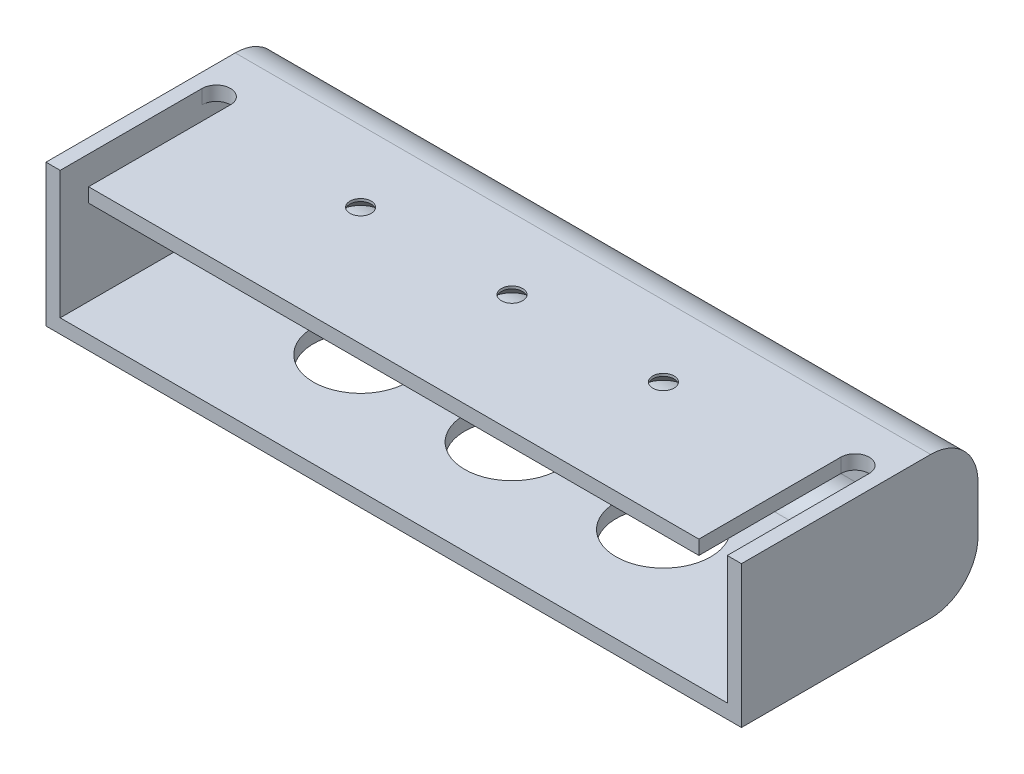
ISO-10303-21;
HEADER;
FILE_DESCRIPTION(('STEP AP214'),'2;1');
FILE_NAME('part.step','',(''),(''),'','','');
FILE_SCHEMA(('AUTOMOTIVE_DESIGN { 1 0 10303 214 1 1 1 1 }'));
ENDSEC;
DATA;
#1=APPLICATION_CONTEXT('core data for automotive mechanical design processes');
#2=APPLICATION_PROTOCOL_DEFINITION('international standard','automotive_design',2000,#1);
#3=PRODUCT_CONTEXT('',#1,'mechanical');
#4=PRODUCT('Part','Part','',(#3));
#5=PRODUCT_RELATED_PRODUCT_CATEGORY('part','',(#4));
#6=PRODUCT_DEFINITION_FORMATION('','',#4);
#7=PRODUCT_DEFINITION_CONTEXT('part definition',#1,'design');
#8=PRODUCT_DEFINITION('design','',#6,#7);
#9=PRODUCT_DEFINITION_SHAPE('','',#8);
#10=(LENGTH_UNIT() NAMED_UNIT(*) SI_UNIT(.MILLI.,.METRE.));
#11=(NAMED_UNIT(*) PLANE_ANGLE_UNIT() SI_UNIT($,.RADIAN.));
#12=(NAMED_UNIT(*) SI_UNIT($,.STERADIAN.) SOLID_ANGLE_UNIT());
#13=UNCERTAINTY_MEASURE_WITH_UNIT(LENGTH_MEASURE(1.E-05),#10,'distance_accuracy_value','');
#14=(GEOMETRIC_REPRESENTATION_CONTEXT(3) GLOBAL_UNCERTAINTY_ASSIGNED_CONTEXT((#13)) GLOBAL_UNIT_ASSIGNED_CONTEXT((#10,
#11,#12)) REPRESENTATION_CONTEXT('',''));
#15=CARTESIAN_POINT('',(0.,0.,0.));
#16=DIRECTION('',(0.,0.,1.));
#17=DIRECTION('',(1.,0.,0.));
#18=AXIS2_PLACEMENT_3D('',#15,#16,#17);
#19=CARTESIAN_POINT('',(-73.5,30.,25.));
#20=DIRECTION('',(0.,0.,-1.));
#21=DIRECTION('',(-1.,0.,0.));
#22=AXIS2_PLACEMENT_3D('',#19,#20,#21);
#23=PLANE('',#22);
#24=DIRECTION('',(0.,1.,0.));
#25=VECTOR('',#24,1.);
#26=CARTESIAN_POINT('',(64.5,-0.001000000000001,25.));
#27=LINE('',#26,#25);
#28=CARTESIAN_POINT('',(64.4999999999999,27.,25.));
#29=VERTEX_POINT('',#28);
#30=CARTESIAN_POINT('',(64.5,30.,25.));
#31=VERTEX_POINT('',#30);
#32=EDGE_CURVE('E159',#29,#31,#27,.T.);
#33=ORIENTED_EDGE('',*,*,#32,.T.);
#34=DIRECTION('',(1.,0.,0.));
#35=VECTOR('',#34,1.);
#36=CARTESIAN_POINT('',(-73.5,30.,25.));
#37=LINE('',#36,#35);
#38=CARTESIAN_POINT('',(-64.5,30.,25.));
#39=VERTEX_POINT('',#38);
#40=EDGE_CURVE('E173',#39,#31,#37,.T.);
#41=ORIENTED_EDGE('',*,*,#40,.F.);
#42=DIRECTION('',(0.,1.,0.));
#43=VECTOR('',#42,1.);
#44=CARTESIAN_POINT('',(-64.5,-0.001000000000001,25.));
#45=LINE('',#44,#43);
#46=CARTESIAN_POINT('',(-64.5,27.,25.));
#47=VERTEX_POINT('',#46);
#48=EDGE_CURVE('E266',#47,#39,#45,.T.);
#49=ORIENTED_EDGE('',*,*,#48,.F.);
#50=DIRECTION('',(1.,0.,0.));
#51=VECTOR('',#50,1.);
#52=CARTESIAN_POINT('',(-73.5,27.,25.));
#53=LINE('',#52,#51);
#54=EDGE_CURVE('E175',#47,#29,#53,.T.);
#55=ORIENTED_EDGE('',*,*,#54,.T.);
#56=EDGE_LOOP('',(#33,#41,#49,#55));
#57=FACE_BOUND('',#56,.T.);
#58=ADVANCED_FACE('F33',(#57),#23,.F.);
#59=CARTESIAN_POINT('',(70.5,30.,25.));
#60=VERTEX_POINT('',#59);
#61=CARTESIAN_POINT('',(73.5,30.,25.));
#62=VERTEX_POINT('',#61);
#63=EDGE_CURVE('E184',#60,#62,#37,.T.);
#64=ORIENTED_EDGE('',*,*,#63,.F.);
#65=DIRECTION('',(0.,-1.,0.));
#66=VECTOR('',#65,1.);
#67=CARTESIAN_POINT('',(70.5,30.,25.));
#68=LINE('',#67,#66);
#69=CARTESIAN_POINT('',(70.5,3.,25.));
#70=VERTEX_POINT('',#69);
#71=EDGE_CURVE('E313',#60,#70,#68,.T.);
#72=ORIENTED_EDGE('',*,*,#71,.T.);
#73=DIRECTION('',(1.,0.,0.));
#74=VECTOR('',#73,1.);
#75=CARTESIAN_POINT('',(-73.5,3.,25.));
#76=LINE('',#75,#74);
#77=CARTESIAN_POINT('',(-70.5,3.,25.));
#78=VERTEX_POINT('',#77);
#79=EDGE_CURVE('E291',#78,#70,#76,.T.);
#80=ORIENTED_EDGE('',*,*,#79,.F.);
#81=DIRECTION('',(0.,-1.,0.));
#82=VECTOR('',#81,1.);
#83=CARTESIAN_POINT('',(-70.5,30.,25.));
#84=LINE('',#83,#82);
#85=CARTESIAN_POINT('',(-70.5,30.,25.));
#86=VERTEX_POINT('',#85);
#87=EDGE_CURVE('E259',#86,#78,#84,.T.);
#88=ORIENTED_EDGE('',*,*,#87,.F.);
#89=CARTESIAN_POINT('',(-73.5,30.,25.));
#90=VERTEX_POINT('',#89);
#91=EDGE_CURVE('E183',#90,#86,#37,.T.);
#92=ORIENTED_EDGE('',*,*,#91,.F.);
#93=DIRECTION('',(0.,-1.,0.));
#94=VECTOR('',#93,1.);
#95=CARTESIAN_POINT('',(-73.5,30.,25.));
#96=LINE('',#95,#94);
#97=CARTESIAN_POINT('',(-73.5,0.,25.));
#98=VERTEX_POINT('',#97);
#99=EDGE_CURVE('E203',#90,#98,#96,.T.);
#100=ORIENTED_EDGE('',*,*,#99,.T.);
#101=DIRECTION('',(1.,0.,0.));
#102=VECTOR('',#101,1.);
#103=CARTESIAN_POINT('',(-73.5,0.,25.));
#104=LINE('',#103,#102);
#105=CARTESIAN_POINT('',(73.5,0.,25.));
#106=VERTEX_POINT('',#105);
#107=EDGE_CURVE('E198',#98,#106,#104,.T.);
#108=ORIENTED_EDGE('',*,*,#107,.T.);
#109=DIRECTION('',(0.,-1.,0.));
#110=VECTOR('',#109,1.);
#111=CARTESIAN_POINT('',(73.5,30.,25.));
#112=LINE('',#111,#110);
#113=EDGE_CURVE('E187',#62,#106,#112,.T.);
#114=ORIENTED_EDGE('',*,*,#113,.F.);
#115=EDGE_LOOP('',(#64,#72,#80,#88,#92,#100,#108,#114));
#116=FACE_BOUND('',#115,.T.);
#117=ADVANCED_FACE('F255',(#116),#23,.F.);
#118=CARTESIAN_POINT('',(0.,30.,0.));
#119=DIRECTION('',(0.,1.,0.));
#120=DIRECTION('',(0.,0.,1.));
#121=AXIS2_PLACEMENT_3D('',#118,#119,#120);
#122=PLANE('',#121);
#123=CARTESIAN_POINT('',(-32.,30.,0.));
#124=DIRECTION('',(0.,-1.,0.));
#125=DIRECTION('',(0.,0.,-1.));
#126=AXIS2_PLACEMENT_3D('',#123,#124,#125);
#127=CIRCLE('',#126,2.25);
#128=CARTESIAN_POINT('',(-32.,30.,-2.24999999999999));
#129=VERTEX_POINT('',#128);
#130=EDGE_CURVE('E394',#129,#129,#127,.T.);
#131=ORIENTED_EDGE('',*,*,#130,.T.);
#132=EDGE_LOOP('',(#131));
#133=FACE_BOUND('',#132,.T.);
#134=CARTESIAN_POINT('',(0.,30.,0.));
#135=DIRECTION('',(0.,-1.,0.));
#136=DIRECTION('',(0.,0.,-1.));
#137=AXIS2_PLACEMENT_3D('',#134,#135,#136);
#138=CIRCLE('',#137,2.25);
#139=CARTESIAN_POINT('',(0.,30.,-2.25));
#140=VERTEX_POINT('',#139);
#141=EDGE_CURVE('E403',#140,#140,#138,.T.);
#142=ORIENTED_EDGE('',*,*,#141,.T.);
#143=EDGE_LOOP('',(#142));
#144=FACE_BOUND('',#143,.T.);
#145=CARTESIAN_POINT('',(32.,30.,0.));
#146=DIRECTION('',(0.,-1.,0.));
#147=DIRECTION('',(0.,0.,-1.));
#148=AXIS2_PLACEMENT_3D('',#145,#146,#147);
#149=CIRCLE('',#148,2.25);
#150=CARTESIAN_POINT('',(32.,30.,-2.25));
#151=VERTEX_POINT('',#150);
#152=EDGE_CURVE('E412',#151,#151,#149,.T.);
#153=ORIENTED_EDGE('',*,*,#152,.T.);
#154=EDGE_LOOP('',(#153));
#155=FACE_BOUND('',#154,.T.);
#156=ORIENTED_EDGE('',*,*,#40,.T.);
#157=DIRECTION('',(0.,0.,-1.));
#158=VECTOR('',#157,1.);
#159=CARTESIAN_POINT('',(64.5,30.,25.));
#160=LINE('',#159,#158);
#161=CARTESIAN_POINT('',(64.5,30.,-5.));
#162=VERTEX_POINT('',#161);
#163=EDGE_CURVE('E156',#31,#162,#160,.T.);
#164=ORIENTED_EDGE('',*,*,#163,.T.);
#165=CARTESIAN_POINT('',(67.5,30.,-5.));
#166=DIRECTION('',(0.,-1.,0.));
#167=DIRECTION('',(0.,0.,1.));
#168=AXIS2_PLACEMENT_3D('',#165,#166,#167);
#169=CIRCLE('',#168,3.);
#170=CARTESIAN_POINT('',(70.5,30.,-5.));
#171=VERTEX_POINT('',#170);
#172=EDGE_CURVE('E415',#162,#171,#169,.T.);
#173=ORIENTED_EDGE('',*,*,#172,.T.);
#174=DIRECTION('',(0.,0.,1.));
#175=VECTOR('',#174,1.);
#176=CARTESIAN_POINT('',(70.5,30.,25.));
#177=LINE('',#176,#175);
#178=EDGE_CURVE('E417',#171,#60,#177,.T.);
#179=ORIENTED_EDGE('',*,*,#178,.T.);
#180=ORIENTED_EDGE('',*,*,#63,.T.);
#181=DIRECTION('',(0.,0.,-1.));
#182=VECTOR('',#181,1.);
#183=CARTESIAN_POINT('',(73.5,30.,-25.));
#184=LINE('',#183,#182);
#185=CARTESIAN_POINT('',(73.5,30.,-15.));
#186=VERTEX_POINT('',#185);
#187=EDGE_CURVE('E200',#62,#186,#184,.T.);
#188=ORIENTED_EDGE('',*,*,#187,.T.);
#189=DIRECTION('',(-1.,0.,0.));
#190=VECTOR('',#189,1.);
#191=CARTESIAN_POINT('',(-73.5,30.,-15.));
#192=LINE('',#191,#190);
#193=CARTESIAN_POINT('',(-73.5,30.,-15.));
#194=VERTEX_POINT('',#193);
#195=EDGE_CURVE('E212',#186,#194,#192,.T.);
#196=ORIENTED_EDGE('',*,*,#195,.T.);
#197=DIRECTION('',(0.,0.,1.));
#198=VECTOR('',#197,1.);
#199=CARTESIAN_POINT('',(-73.5,30.,-25.));
#200=LINE('',#199,#198);
#201=EDGE_CURVE('E188',#194,#90,#200,.T.);
#202=ORIENTED_EDGE('',*,*,#201,.T.);
#203=ORIENTED_EDGE('',*,*,#91,.T.);
#204=DIRECTION('',(0.,0.,1.));
#205=VECTOR('',#204,1.);
#206=CARTESIAN_POINT('',(-70.5,30.,25.));
#207=LINE('',#206,#205);
#208=CARTESIAN_POINT('',(-70.5,30.,-5.));
#209=VERTEX_POINT('',#208);
#210=EDGE_CURVE('E262',#209,#86,#207,.T.);
#211=ORIENTED_EDGE('',*,*,#210,.F.);
#212=CARTESIAN_POINT('',(-67.5,30.,-5.));
#213=DIRECTION('',(0.,1.,0.));
#214=DIRECTION('',(0.,0.,1.));
#215=AXIS2_PLACEMENT_3D('',#212,#213,#214);
#216=CIRCLE('',#215,3.);
#217=CARTESIAN_POINT('',(-64.5,30.,-5.));
#218=VERTEX_POINT('',#217);
#219=EDGE_CURVE('E264',#218,#209,#216,.T.);
#220=ORIENTED_EDGE('',*,*,#219,.F.);
#221=DIRECTION('',(0.,0.,-1.));
#222=VECTOR('',#221,1.);
#223=CARTESIAN_POINT('',(-64.5,30.,25.));
#224=LINE('',#223,#222);
#225=EDGE_CURVE('E182',#39,#218,#224,.T.);
#226=ORIENTED_EDGE('',*,*,#225,.F.);
#227=EDGE_LOOP('',(#156,#164,#173,#179,#180,#188,#196,#202,#203,#211,#220,#226));
#228=FACE_BOUND('',#227,.T.);
#229=ADVANCED_FACE('F179',(#133,#144,#155,#228),#122,.T.);
#230=CARTESIAN_POINT('',(0.,27.,0.));
#231=DIRECTION('',(0.,1.,0.));
#232=DIRECTION('',(0.,0.,1.));
#233=AXIS2_PLACEMENT_3D('',#230,#231,#232);
#234=PLANE('',#233);
#235=CARTESIAN_POINT('',(-32.,27.,0.));
#236=DIRECTION('',(0.,-1.,0.));
#237=DIRECTION('',(0.,0.,-1.));
#238=AXIS2_PLACEMENT_3D('',#235,#236,#237);
#239=CIRCLE('',#238,4.7);
#240=CARTESIAN_POINT('',(-32.,27.,-4.69999999999999));
#241=VERTEX_POINT('',#240);
#242=EDGE_CURVE('E380',#241,#241,#239,.T.);
#243=ORIENTED_EDGE('',*,*,#242,.F.);
#244=EDGE_LOOP('',(#243));
#245=FACE_BOUND('',#244,.T.);
#246=CARTESIAN_POINT('',(0.,27.,0.));
#247=DIRECTION('',(0.,-1.,0.));
#248=DIRECTION('',(0.,0.,-1.));
#249=AXIS2_PLACEMENT_3D('',#246,#247,#248);
#250=CIRCLE('',#249,4.7);
#251=CARTESIAN_POINT('',(0.,27.,-4.7));
#252=VERTEX_POINT('',#251);
#253=EDGE_CURVE('E397',#252,#252,#250,.T.);
#254=ORIENTED_EDGE('',*,*,#253,.F.);
#255=EDGE_LOOP('',(#254));
#256=FACE_BOUND('',#255,.T.);
#257=CARTESIAN_POINT('',(32.,27.,0.));
#258=DIRECTION('',(0.,-1.,0.));
#259=DIRECTION('',(0.,0.,-1.));
#260=AXIS2_PLACEMENT_3D('',#257,#258,#259);
#261=CIRCLE('',#260,4.7);
#262=CARTESIAN_POINT('',(32.,27.,-4.69999999999999));
#263=VERTEX_POINT('',#262);
#264=EDGE_CURVE('E406',#263,#263,#261,.T.);
#265=ORIENTED_EDGE('',*,*,#264,.F.);
#266=EDGE_LOOP('',(#265));
#267=FACE_BOUND('',#266,.T.);
#268=DIRECTION('',(0.,0.,1.));
#269=VECTOR('',#268,1.);
#270=CARTESIAN_POINT('',(64.5,27.,25.));
#271=LINE('',#270,#269);
#272=CARTESIAN_POINT('',(64.5,27.,-5.));
#273=VERTEX_POINT('',#272);
#274=EDGE_CURVE('E176',#273,#29,#271,.T.);
#275=ORIENTED_EDGE('',*,*,#274,.T.);
#276=ORIENTED_EDGE('',*,*,#54,.F.);
#277=DIRECTION('',(0.,0.,1.));
#278=VECTOR('',#277,1.);
#279=CARTESIAN_POINT('',(-64.5,27.,25.));
#280=LINE('',#279,#278);
#281=CARTESIAN_POINT('',(-64.5,27.,-5.));
#282=VERTEX_POINT('',#281);
#283=EDGE_CURVE('E275',#282,#47,#280,.T.);
#284=ORIENTED_EDGE('',*,*,#283,.F.);
#285=CARTESIAN_POINT('',(-67.5,27.,-5.));
#286=DIRECTION('',(0.,1.,0.));
#287=DIRECTION('',(0.,0.,1.));
#288=AXIS2_PLACEMENT_3D('',#285,#286,#287);
#289=CIRCLE('',#288,3.);
#290=CARTESIAN_POINT('',(-70.5,27.,-5.));
#291=VERTEX_POINT('',#290);
#292=EDGE_CURVE('E56',#291,#282,#289,.F.);
#293=ORIENTED_EDGE('',*,*,#292,.F.);
#294=DIRECTION('',(0.,0.,1.));
#295=VECTOR('',#294,1.);
#296=CARTESIAN_POINT('',(-70.5,27.,-25.));
#297=LINE('',#296,#295);
#298=CARTESIAN_POINT('',(-70.5,27.,-15.));
#299=VERTEX_POINT('',#298);
#300=EDGE_CURVE('E290',#299,#291,#297,.T.);
#301=ORIENTED_EDGE('',*,*,#300,.F.);
#302=DIRECTION('',(1.,0.,0.));
#303=VECTOR('',#302,1.);
#304=CARTESIAN_POINT('',(0.,27.,-15.));
#305=LINE('',#304,#303);
#306=CARTESIAN_POINT('',(70.5,27.,-15.));
#307=VERTEX_POINT('',#306);
#308=EDGE_CURVE('E282',#307,#299,#305,.F.);
#309=ORIENTED_EDGE('',*,*,#308,.F.);
#310=DIRECTION('',(0.,0.,-1.));
#311=VECTOR('',#310,1.);
#312=CARTESIAN_POINT('',(70.5,27.,-25.));
#313=LINE('',#312,#311);
#314=CARTESIAN_POINT('',(70.5,27.,-5.));
#315=VERTEX_POINT('',#314);
#316=EDGE_CURVE('E288',#315,#307,#313,.T.);
#317=ORIENTED_EDGE('',*,*,#316,.F.);
#318=CARTESIAN_POINT('',(67.5,27.,-5.));
#319=DIRECTION('',(0.,1.,0.));
#320=DIRECTION('',(0.,0.,1.));
#321=AXIS2_PLACEMENT_3D('',#318,#319,#320);
#322=CIRCLE('',#321,3.);
#323=EDGE_CURVE('E167',#315,#273,#322,.T.);
#324=ORIENTED_EDGE('',*,*,#323,.T.);
#325=EDGE_LOOP('',(#275,#276,#284,#293,#301,#309,#317,#324));
#326=FACE_BOUND('',#325,.T.);
#327=ADVANCED_FACE('F359',(#245,#256,#267,#326),#234,.F.);
#328=CARTESIAN_POINT('',(73.5,30.,-25.));
#329=DIRECTION('',(-1.,0.,0.));
#330=DIRECTION('',(0.,0.,1.));
#331=AXIS2_PLACEMENT_3D('',#328,#329,#330);
#332=PLANE('',#331);
#333=DIRECTION('',(0.,-1.,0.));
#334=VECTOR('',#333,1.);
#335=CARTESIAN_POINT('',(73.5,30.,-25.));
#336=LINE('',#335,#334);
#337=CARTESIAN_POINT('',(73.5,20.,-25.));
#338=VERTEX_POINT('',#337);
#339=CARTESIAN_POINT('',(73.5,10.,-25.));
#340=VERTEX_POINT('',#339);
#341=EDGE_CURVE('E209',#338,#340,#336,.T.);
#342=ORIENTED_EDGE('',*,*,#341,.F.);
#343=CARTESIAN_POINT('',(73.5,20.,-15.));
#344=DIRECTION('',(-1.,0.,0.));
#345=DIRECTION('',(0.,0.,1.));
#346=AXIS2_PLACEMENT_3D('',#343,#344,#345);
#347=CIRCLE('',#346,10.);
#348=EDGE_CURVE('E41',#338,#186,#347,.F.);
#349=ORIENTED_EDGE('',*,*,#348,.T.);
#350=ORIENTED_EDGE('',*,*,#187,.F.);
#351=ORIENTED_EDGE('',*,*,#113,.T.);
#352=DIRECTION('',(0.,0.,-1.));
#353=VECTOR('',#352,1.);
#354=CARTESIAN_POINT('',(73.5,0.,-25.));
#355=LINE('',#354,#353);
#356=CARTESIAN_POINT('',(73.5,0.,-15.));
#357=VERTEX_POINT('',#356);
#358=EDGE_CURVE('E192',#106,#357,#355,.T.);
#359=ORIENTED_EDGE('',*,*,#358,.T.);
#360=CARTESIAN_POINT('',(73.5,10.,-15.));
#361=DIRECTION('',(-1.,0.,0.));
#362=DIRECTION('',(0.,0.,1.));
#363=AXIS2_PLACEMENT_3D('',#360,#361,#362);
#364=CIRCLE('',#363,10.);
#365=EDGE_CURVE('E224',#357,#340,#364,.F.);
#366=ORIENTED_EDGE('',*,*,#365,.T.);
#367=EDGE_LOOP('',(#342,#349,#350,#351,#359,#366));
#368=FACE_BOUND('',#367,.T.);
#369=ADVANCED_FACE('F230',(#368),#332,.F.);
#370=CARTESIAN_POINT('',(-73.5,30.,-25.));
#371=DIRECTION('',(0.,0.,1.));
#372=DIRECTION('',(1.,0.,0.));
#373=AXIS2_PLACEMENT_3D('',#370,#371,#372);
#374=PLANE('',#373);
#375=DIRECTION('',(0.,-1.,0.));
#376=VECTOR('',#375,1.);
#377=CARTESIAN_POINT('',(-73.5,30.,-25.));
#378=LINE('',#377,#376);
#379=CARTESIAN_POINT('',(-73.5,20.,-25.));
#380=VERTEX_POINT('',#379);
#381=CARTESIAN_POINT('',(-73.5,10.,-25.));
#382=VERTEX_POINT('',#381);
#383=EDGE_CURVE('E206',#380,#382,#378,.T.);
#384=ORIENTED_EDGE('',*,*,#383,.F.);
#385=DIRECTION('',(-1.,0.,0.));
#386=VECTOR('',#385,1.);
#387=CARTESIAN_POINT('',(73.5,20.,-25.));
#388=LINE('',#387,#386);
#389=EDGE_CURVE('E222',#380,#338,#388,.F.);
#390=ORIENTED_EDGE('',*,*,#389,.T.);
#391=ORIENTED_EDGE('',*,*,#341,.T.);
#392=DIRECTION('',(-1.,0.,0.));
#393=VECTOR('',#392,1.);
#394=CARTESIAN_POINT('',(-73.5,10.,-25.));
#395=LINE('',#394,#393);
#396=EDGE_CURVE('E219',#340,#382,#395,.T.);
#397=ORIENTED_EDGE('',*,*,#396,.T.);
#398=EDGE_LOOP('',(#384,#390,#391,#397));
#399=FACE_BOUND('',#398,.T.);
#400=ADVANCED_FACE('F244',(#399),#374,.F.);
#401=CARTESIAN_POINT('',(-73.5,30.,-25.));
#402=DIRECTION('',(1.,0.,0.));
#403=DIRECTION('',(0.,0.,-1.));
#404=AXIS2_PLACEMENT_3D('',#401,#402,#403);
#405=PLANE('',#404);
#406=ORIENTED_EDGE('',*,*,#201,.F.);
#407=CARTESIAN_POINT('',(-73.5,20.,-15.));
#408=DIRECTION('',(1.,0.,0.));
#409=DIRECTION('',(0.,0.,-1.));
#410=AXIS2_PLACEMENT_3D('',#407,#408,#409);
#411=CIRCLE('',#410,10.);
#412=EDGE_CURVE('E217',#194,#380,#411,.F.);
#413=ORIENTED_EDGE('',*,*,#412,.T.);
#414=ORIENTED_EDGE('',*,*,#383,.T.);
#415=CARTESIAN_POINT('',(-73.5,10.,-15.));
#416=DIRECTION('',(1.,0.,0.));
#417=DIRECTION('',(0.,0.,-1.));
#418=AXIS2_PLACEMENT_3D('',#415,#416,#417);
#419=CIRCLE('',#418,10.);
#420=CARTESIAN_POINT('',(-73.5,0.,-15.));
#421=VERTEX_POINT('',#420);
#422=EDGE_CURVE('E215',#382,#421,#419,.F.);
#423=ORIENTED_EDGE('',*,*,#422,.T.);
#424=DIRECTION('',(0.,0.,1.));
#425=VECTOR('',#424,1.);
#426=CARTESIAN_POINT('',(-73.5,0.,-25.));
#427=LINE('',#426,#425);
#428=EDGE_CURVE('E195',#421,#98,#427,.T.);
#429=ORIENTED_EDGE('',*,*,#428,.T.);
#430=ORIENTED_EDGE('',*,*,#99,.F.);
#431=EDGE_LOOP('',(#406,#413,#414,#423,#429,#430));
#432=FACE_BOUND('',#431,.T.);
#433=ADVANCED_FACE('F241',(#432),#405,.F.);
#434=CARTESIAN_POINT('',(0.,0.,0.));
#435=DIRECTION('',(0.,1.,0.));
#436=DIRECTION('',(0.,0.,1.));
#437=AXIS2_PLACEMENT_3D('',#434,#435,#436);
#438=PLANE('',#437);
#439=CARTESIAN_POINT('',(32.,0.,0.));
#440=DIRECTION('',(0.,-1.,0.));
#441=DIRECTION('',(0.,0.,-1.));
#442=AXIS2_PLACEMENT_3D('',#439,#440,#441);
#443=CIRCLE('',#442,10.);
#444=CARTESIAN_POINT('',(32.,0.,-10.));
#445=VERTEX_POINT('',#444);
#446=EDGE_CURVE('E371',#445,#445,#443,.T.);
#447=ORIENTED_EDGE('',*,*,#446,.F.);
#448=EDGE_LOOP('',(#447));
#449=FACE_BOUND('',#448,.T.);
#450=CARTESIAN_POINT('',(-32.,0.,0.));
#451=DIRECTION('',(0.,-1.,0.));
#452=DIRECTION('',(0.,0.,-1.));
#453=AXIS2_PLACEMENT_3D('',#450,#451,#452);
#454=CIRCLE('',#453,10.);
#455=CARTESIAN_POINT('',(-32.,0.,-9.99999999999999));
#456=VERTEX_POINT('',#455);
#457=EDGE_CURVE('E375',#456,#456,#454,.T.);
#458=ORIENTED_EDGE('',*,*,#457,.F.);
#459=EDGE_LOOP('',(#458));
#460=FACE_BOUND('',#459,.T.);
#461=CARTESIAN_POINT('',(0.,0.,0.));
#462=DIRECTION('',(0.,-1.,0.));
#463=DIRECTION('',(0.,0.,-1.));
#464=AXIS2_PLACEMENT_3D('',#461,#462,#463);
#465=CIRCLE('',#464,10.);
#466=CARTESIAN_POINT('',(0.,0.,-10.));
#467=VERTEX_POINT('',#466);
#468=EDGE_CURVE('E378',#467,#467,#465,.T.);
#469=ORIENTED_EDGE('',*,*,#468,.F.);
#470=EDGE_LOOP('',(#469));
#471=FACE_BOUND('',#470,.T.);
#472=ORIENTED_EDGE('',*,*,#428,.F.);
#473=DIRECTION('',(-1.,0.,0.));
#474=VECTOR('',#473,1.);
#475=CARTESIAN_POINT('',(0.,0.,-15.));
#476=LINE('',#475,#474);
#477=EDGE_CURVE('E11',#421,#357,#476,.F.);
#478=ORIENTED_EDGE('',*,*,#477,.T.);
#479=ORIENTED_EDGE('',*,*,#358,.F.);
#480=ORIENTED_EDGE('',*,*,#107,.F.);
#481=EDGE_LOOP('',(#472,#478,#479,#480));
#482=FACE_BOUND('',#481,.T.);
#483=ADVANCED_FACE('F252',(#449,#460,#471,#482),#438,.F.);
#484=CARTESIAN_POINT('',(0.,20.,-15.));
#485=DIRECTION('',(1.,0.,0.));
#486=DIRECTION('',(0.,0.,-1.));
#487=AXIS2_PLACEMENT_3D('',#484,#485,#486);
#488=CYLINDRICAL_SURFACE('',#487,10.);
#489=ORIENTED_EDGE('',*,*,#348,.F.);
#490=ORIENTED_EDGE('',*,*,#389,.F.);
#491=ORIENTED_EDGE('',*,*,#412,.F.);
#492=ORIENTED_EDGE('',*,*,#195,.F.);
#493=EDGE_LOOP('',(#489,#490,#491,#492));
#494=FACE_BOUND('',#493,.T.);
#495=ADVANCED_FACE('F238',(#494),#488,.T.);
#496=CARTESIAN_POINT('',(-73.5,10.,-15.));
#497=DIRECTION('',(-1.,0.,0.));
#498=DIRECTION('',(0.,0.,1.));
#499=AXIS2_PLACEMENT_3D('',#496,#497,#498);
#500=CYLINDRICAL_SURFACE('',#499,10.);
#501=ORIENTED_EDGE('',*,*,#365,.F.);
#502=ORIENTED_EDGE('',*,*,#477,.F.);
#503=ORIENTED_EDGE('',*,*,#422,.F.);
#504=ORIENTED_EDGE('',*,*,#396,.F.);
#505=EDGE_LOOP('',(#501,#502,#503,#504));
#506=FACE_BOUND('',#505,.T.);
#507=ADVANCED_FACE('F35',(#506),#500,.T.);
#508=CARTESIAN_POINT('',(70.5,30.,-25.));
#509=DIRECTION('',(-1.,0.,0.));
#510=DIRECTION('',(0.,0.,1.));
#511=AXIS2_PLACEMENT_3D('',#508,#509,#510);
#512=PLANE('',#511);
#513=DIRECTION('',(0.,-1.,0.));
#514=VECTOR('',#513,1.);
#515=CARTESIAN_POINT('',(70.5,30.,-22.));
#516=LINE('',#515,#514);
#517=CARTESIAN_POINT('',(70.5,20.,-22.));
#518=VERTEX_POINT('',#517);
#519=CARTESIAN_POINT('',(70.5,10.,-22.));
#520=VERTEX_POINT('',#519);
#521=EDGE_CURVE('E279',#518,#520,#516,.T.);
#522=ORIENTED_EDGE('',*,*,#521,.T.);
#523=CARTESIAN_POINT('',(70.5,10.,-15.));
#524=DIRECTION('',(-1.,0.,0.));
#525=DIRECTION('',(0.,0.,1.));
#526=AXIS2_PLACEMENT_3D('',#523,#524,#525);
#527=CIRCLE('',#526,7.);
#528=CARTESIAN_POINT('',(70.5,3.,-15.));
#529=VERTEX_POINT('',#528);
#530=EDGE_CURVE('E287',#529,#520,#527,.F.);
#531=ORIENTED_EDGE('',*,*,#530,.F.);
#532=DIRECTION('',(0.,0.,-1.));
#533=VECTOR('',#532,1.);
#534=CARTESIAN_POINT('',(70.5,3.,-25.));
#535=LINE('',#534,#533);
#536=EDGE_CURVE('E278',#70,#529,#535,.T.);
#537=ORIENTED_EDGE('',*,*,#536,.F.);
#538=ORIENTED_EDGE('',*,*,#71,.F.);
#539=ORIENTED_EDGE('',*,*,#178,.F.);
#540=DIRECTION('',(0.,1.,0.));
#541=VECTOR('',#540,1.);
#542=CARTESIAN_POINT('',(70.5,-0.001000000000001,-5.));
#543=LINE('',#542,#541);
#544=EDGE_CURVE('E48',#315,#171,#543,.T.);
#545=ORIENTED_EDGE('',*,*,#544,.F.);
#546=ORIENTED_EDGE('',*,*,#316,.T.);
#547=CARTESIAN_POINT('',(70.5,20.,-15.));
#548=DIRECTION('',(-1.,0.,0.));
#549=DIRECTION('',(0.,0.,1.));
#550=AXIS2_PLACEMENT_3D('',#547,#548,#549);
#551=CIRCLE('',#550,7.);
#552=EDGE_CURVE('E284',#518,#307,#551,.F.);
#553=ORIENTED_EDGE('',*,*,#552,.F.);
#554=EDGE_LOOP('',(#522,#531,#537,#538,#539,#545,#546,#553));
#555=FACE_BOUND('',#554,.T.);
#556=ADVANCED_FACE('F324',(#555),#512,.T.);
#557=CARTESIAN_POINT('',(-73.5,30.,-22.));
#558=DIRECTION('',(0.,0.,1.));
#559=DIRECTION('',(1.,0.,0.));
#560=AXIS2_PLACEMENT_3D('',#557,#558,#559);
#561=PLANE('',#560);
#562=DIRECTION('',(0.,-1.,0.));
#563=VECTOR('',#562,1.);
#564=CARTESIAN_POINT('',(-70.5,30.,-22.));
#565=LINE('',#564,#563);
#566=CARTESIAN_POINT('',(-70.5,20.,-22.));
#567=VERTEX_POINT('',#566);
#568=CARTESIAN_POINT('',(-70.5,10.,-22.));
#569=VERTEX_POINT('',#568);
#570=EDGE_CURVE('E283',#567,#569,#565,.T.);
#571=ORIENTED_EDGE('',*,*,#570,.T.);
#572=DIRECTION('',(1.,0.,0.));
#573=VECTOR('',#572,1.);
#574=CARTESIAN_POINT('',(-73.5,10.,-22.));
#575=LINE('',#574,#573);
#576=EDGE_CURVE('E300',#520,#569,#575,.F.);
#577=ORIENTED_EDGE('',*,*,#576,.F.);
#578=ORIENTED_EDGE('',*,*,#521,.F.);
#579=DIRECTION('',(1.,0.,0.));
#580=VECTOR('',#579,1.);
#581=CARTESIAN_POINT('',(-73.5,20.,-22.));
#582=LINE('',#581,#580);
#583=EDGE_CURVE('E296',#567,#518,#582,.T.);
#584=ORIENTED_EDGE('',*,*,#583,.F.);
#585=EDGE_LOOP('',(#571,#577,#578,#584));
#586=FACE_BOUND('',#585,.T.);
#587=ADVANCED_FACE('F334',(#586),#561,.T.);
#588=CARTESIAN_POINT('',(-70.5,30.,-25.));
#589=DIRECTION('',(1.,0.,0.));
#590=DIRECTION('',(0.,0.,-1.));
#591=AXIS2_PLACEMENT_3D('',#588,#589,#590);
#592=PLANE('',#591);
#593=ORIENTED_EDGE('',*,*,#300,.T.);
#594=DIRECTION('',(0.,1.,0.));
#595=VECTOR('',#594,1.);
#596=CARTESIAN_POINT('',(-70.5,-0.001000000000001,-5.));
#597=LINE('',#596,#595);
#598=EDGE_CURVE('E273',#291,#209,#597,.T.);
#599=ORIENTED_EDGE('',*,*,#598,.T.);
#600=ORIENTED_EDGE('',*,*,#210,.T.);
#601=ORIENTED_EDGE('',*,*,#87,.T.);
#602=DIRECTION('',(0.,0.,1.));
#603=VECTOR('',#602,1.);
#604=CARTESIAN_POINT('',(-70.5,3.,-25.));
#605=LINE('',#604,#603);
#606=CARTESIAN_POINT('',(-70.5,3.,-15.));
#607=VERTEX_POINT('',#606);
#608=EDGE_CURVE('E294',#607,#78,#605,.T.);
#609=ORIENTED_EDGE('',*,*,#608,.F.);
#610=CARTESIAN_POINT('',(-70.5,10.,-15.));
#611=DIRECTION('',(1.,0.,0.));
#612=DIRECTION('',(0.,0.,-1.));
#613=AXIS2_PLACEMENT_3D('',#610,#611,#612);
#614=CIRCLE('',#613,7.);
#615=EDGE_CURVE('E307',#569,#607,#614,.F.);
#616=ORIENTED_EDGE('',*,*,#615,.F.);
#617=ORIENTED_EDGE('',*,*,#570,.F.);
#618=CARTESIAN_POINT('',(-70.5,20.,-15.));
#619=DIRECTION('',(1.,0.,0.));
#620=DIRECTION('',(0.,0.,-1.));
#621=AXIS2_PLACEMENT_3D('',#618,#619,#620);
#622=CIRCLE('',#621,7.);
#623=EDGE_CURVE('E303',#299,#567,#622,.F.);
#624=ORIENTED_EDGE('',*,*,#623,.F.);
#625=EDGE_LOOP('',(#593,#599,#600,#601,#609,#616,#617,#624));
#626=FACE_BOUND('',#625,.T.);
#627=ADVANCED_FACE('F331',(#626),#592,.T.);
#628=CARTESIAN_POINT('',(0.,3.,0.));
#629=DIRECTION('',(0.,1.,0.));
#630=DIRECTION('',(0.,0.,1.));
#631=AXIS2_PLACEMENT_3D('',#628,#629,#630);
#632=PLANE('',#631);
#633=CARTESIAN_POINT('',(32.,3.,0.));
#634=DIRECTION('',(0.,1.,0.));
#635=DIRECTION('',(0.,0.,1.));
#636=AXIS2_PLACEMENT_3D('',#633,#634,#635);
#637=CIRCLE('',#636,10.);
#638=CARTESIAN_POINT('',(32.,3.,10.));
#639=VERTEX_POINT('',#638);
#640=EDGE_CURVE('E637',#639,#639,#637,.F.);
#641=ORIENTED_EDGE('',*,*,#640,.T.);
#642=EDGE_LOOP('',(#641));
#643=FACE_BOUND('',#642,.T.);
#644=CARTESIAN_POINT('',(-32.,3.,0.));
#645=DIRECTION('',(0.,1.,0.));
#646=DIRECTION('',(0.,0.,1.));
#647=AXIS2_PLACEMENT_3D('',#644,#645,#646);
#648=CIRCLE('',#647,10.);
#649=CARTESIAN_POINT('',(-32.,3.,10.));
#650=VERTEX_POINT('',#649);
#651=EDGE_CURVE('E389',#650,#650,#648,.F.);
#652=ORIENTED_EDGE('',*,*,#651,.T.);
#653=EDGE_LOOP('',(#652));
#654=FACE_BOUND('',#653,.T.);
#655=CARTESIAN_POINT('',(0.,3.,0.));
#656=DIRECTION('',(0.,1.,0.));
#657=DIRECTION('',(0.,0.,1.));
#658=AXIS2_PLACEMENT_3D('',#655,#656,#657);
#659=CIRCLE('',#658,10.);
#660=CARTESIAN_POINT('',(0.,3.,10.));
#661=VERTEX_POINT('',#660);
#662=EDGE_CURVE('E381',#661,#661,#659,.F.);
#663=ORIENTED_EDGE('',*,*,#662,.T.);
#664=EDGE_LOOP('',(#663));
#665=FACE_BOUND('',#664,.T.);
#666=ORIENTED_EDGE('',*,*,#608,.T.);
#667=ORIENTED_EDGE('',*,*,#79,.T.);
#668=ORIENTED_EDGE('',*,*,#536,.T.);
#669=DIRECTION('',(1.,0.,0.));
#670=VECTOR('',#669,1.);
#671=CARTESIAN_POINT('',(0.,3.,-15.));
#672=LINE('',#671,#670);
#673=EDGE_CURVE('E196',#607,#529,#672,.T.);
#674=ORIENTED_EDGE('',*,*,#673,.F.);
#675=EDGE_LOOP('',(#666,#667,#668,#674));
#676=FACE_BOUND('',#675,.T.);
#677=ADVANCED_FACE('F320',(#643,#654,#665,#676),#632,.T.);
#678=CARTESIAN_POINT('',(0.,20.,-15.));
#679=DIRECTION('',(1.,0.,0.));
#680=DIRECTION('',(0.,0.,-1.));
#681=AXIS2_PLACEMENT_3D('',#678,#679,#680);
#682=CYLINDRICAL_SURFACE('',#681,7.);
#683=ORIENTED_EDGE('',*,*,#552,.T.);
#684=ORIENTED_EDGE('',*,*,#308,.T.);
#685=ORIENTED_EDGE('',*,*,#623,.T.);
#686=ORIENTED_EDGE('',*,*,#583,.T.);
#687=EDGE_LOOP('',(#683,#684,#685,#686));
#688=FACE_BOUND('',#687,.T.);
#689=ADVANCED_FACE('F340',(#688),#682,.F.);
#690=CARTESIAN_POINT('',(-73.5,10.,-15.));
#691=DIRECTION('',(-1.,0.,0.));
#692=DIRECTION('',(0.,0.,1.));
#693=AXIS2_PLACEMENT_3D('',#690,#691,#692);
#694=CYLINDRICAL_SURFACE('',#693,7.);
#695=ORIENTED_EDGE('',*,*,#530,.T.);
#696=ORIENTED_EDGE('',*,*,#576,.T.);
#697=ORIENTED_EDGE('',*,*,#615,.T.);
#698=ORIENTED_EDGE('',*,*,#673,.T.);
#699=EDGE_LOOP('',(#695,#696,#697,#698));
#700=FACE_BOUND('',#699,.T.);
#701=ADVANCED_FACE('F329',(#700),#694,.F.);
#702=CARTESIAN_POINT('',(-67.5,-0.001000000000001,-5.));
#703=DIRECTION('',(0.,1.,0.));
#704=DIRECTION('',(0.,0.,1.));
#705=AXIS2_PLACEMENT_3D('',#702,#703,#704);
#706=CYLINDRICAL_SURFACE('',#705,3.);
#707=ORIENTED_EDGE('',*,*,#292,.T.);
#708=DIRECTION('',(0.,1.,0.));
#709=VECTOR('',#708,1.);
#710=CARTESIAN_POINT('',(-64.5,-0.001000000000001,-5.));
#711=LINE('',#710,#709);
#712=EDGE_CURVE('E268',#282,#218,#711,.T.);
#713=ORIENTED_EDGE('',*,*,#712,.T.);
#714=ORIENTED_EDGE('',*,*,#219,.T.);
#715=ORIENTED_EDGE('',*,*,#598,.F.);
#716=EDGE_LOOP('',(#707,#713,#714,#715));
#717=FACE_BOUND('',#716,.T.);
#718=ADVANCED_FACE('F439',(#717),#706,.F.);
#719=CARTESIAN_POINT('',(-64.5,-0.001000000000001,25.));
#720=DIRECTION('',(1.,0.,0.));
#721=DIRECTION('',(0.,0.,-1.));
#722=AXIS2_PLACEMENT_3D('',#719,#720,#721);
#723=PLANE('',#722);
#724=ORIENTED_EDGE('',*,*,#283,.T.);
#725=ORIENTED_EDGE('',*,*,#48,.T.);
#726=ORIENTED_EDGE('',*,*,#225,.T.);
#727=ORIENTED_EDGE('',*,*,#712,.F.);
#728=EDGE_LOOP('',(#724,#725,#726,#727));
#729=FACE_BOUND('',#728,.T.);
#730=ADVANCED_FACE('F425',(#729),#723,.F.);
#731=CARTESIAN_POINT('',(64.5,-0.001000000000001,25.));
#732=DIRECTION('',(1.,0.,0.));
#733=DIRECTION('',(0.,0.,-1.));
#734=AXIS2_PLACEMENT_3D('',#731,#732,#733);
#735=PLANE('',#734);
#736=DIRECTION('',(0.,1.,0.));
#737=VECTOR('',#736,1.);
#738=CARTESIAN_POINT('',(64.5,-0.001000000000001,-5.));
#739=LINE('',#738,#737);
#740=EDGE_CURVE('E162',#273,#162,#739,.T.);
#741=ORIENTED_EDGE('',*,*,#740,.T.);
#742=ORIENTED_EDGE('',*,*,#163,.F.);
#743=ORIENTED_EDGE('',*,*,#32,.F.);
#744=ORIENTED_EDGE('',*,*,#274,.F.);
#745=EDGE_LOOP('',(#741,#742,#743,#744));
#746=FACE_BOUND('',#745,.T.);
#747=ADVANCED_FACE('F158',(#746),#735,.T.);
#748=CARTESIAN_POINT('',(67.5,-0.001000000000001,-5.));
#749=DIRECTION('',(0.,1.,0.));
#750=DIRECTION('',(0.,0.,1.));
#751=AXIS2_PLACEMENT_3D('',#748,#749,#750);
#752=CYLINDRICAL_SURFACE('',#751,3.);
#753=ORIENTED_EDGE('',*,*,#544,.T.);
#754=ORIENTED_EDGE('',*,*,#172,.F.);
#755=ORIENTED_EDGE('',*,*,#740,.F.);
#756=ORIENTED_EDGE('',*,*,#323,.F.);
#757=EDGE_LOOP('',(#753,#754,#755,#756));
#758=FACE_BOUND('',#757,.T.);
#759=ADVANCED_FACE('F430',(#758),#752,.F.);
#760=CARTESIAN_POINT('',(32.,27.,0.));
#761=DIRECTION('',(0.,-1.,0.));
#762=DIRECTION('',(0.,0.,-1.));
#763=AXIS2_PLACEMENT_3D('',#760,#761,#762);
#764=CYLINDRICAL_SURFACE('',#763,2.25);
#765=ORIENTED_EDGE('',*,*,#152,.F.);
#766=EDGE_LOOP('',(#765));
#767=FACE_BOUND('',#766,.T.);
#768=CARTESIAN_POINT('',(32.,29.45,0.));
#769=DIRECTION('',(0.,-1.,0.));
#770=DIRECTION('',(0.,0.,-1.));
#771=AXIS2_PLACEMENT_3D('',#768,#769,#770);
#772=CIRCLE('',#771,2.24999999999999);
#773=CARTESIAN_POINT('',(32.,29.45,-2.24999999999998));
#774=VERTEX_POINT('',#773);
#775=EDGE_CURVE('E409',#774,#774,#772,.T.);
#776=ORIENTED_EDGE('',*,*,#775,.T.);
#777=EDGE_LOOP('',(#776));
#778=FACE_BOUND('',#777,.T.);
#779=ADVANCED_FACE('F453',(#767,#778),#764,.F.);
#780=CARTESIAN_POINT('',(32.,27.,0.));
#781=DIRECTION('',(0.,-1.,0.));
#782=DIRECTION('',(0.,0.,-1.));
#783=AXIS2_PLACEMENT_3D('',#780,#781,#782);
#784=CONICAL_SURFACE('',#783,4.7,0.785398163397448);
#785=ORIENTED_EDGE('',*,*,#775,.F.);
#786=EDGE_LOOP('',(#785));
#787=FACE_BOUND('',#786,.T.);
#788=ORIENTED_EDGE('',*,*,#264,.T.);
#789=EDGE_LOOP('',(#788));
#790=FACE_BOUND('',#789,.T.);
#791=ADVANCED_FACE('F456',(#787,#790),#784,.F.);
#792=CARTESIAN_POINT('',(0.,27.,0.));
#793=DIRECTION('',(0.,-1.,0.));
#794=DIRECTION('',(0.,0.,-1.));
#795=AXIS2_PLACEMENT_3D('',#792,#793,#794);
#796=CYLINDRICAL_SURFACE('',#795,2.24999999999999);
#797=ORIENTED_EDGE('',*,*,#141,.F.);
#798=EDGE_LOOP('',(#797));
#799=FACE_BOUND('',#798,.T.);
#800=CARTESIAN_POINT('',(0.,29.45,0.));
#801=DIRECTION('',(0.,-1.,0.));
#802=DIRECTION('',(0.,0.,-1.));
#803=AXIS2_PLACEMENT_3D('',#800,#801,#802);
#804=CIRCLE('',#803,2.24999999999999);
#805=CARTESIAN_POINT('',(0.,29.45,-2.24999999999999));
#806=VERTEX_POINT('',#805);
#807=EDGE_CURVE('E400',#806,#806,#804,.T.);
#808=ORIENTED_EDGE('',*,*,#807,.T.);
#809=EDGE_LOOP('',(#808));
#810=FACE_BOUND('',#809,.T.);
#811=ADVANCED_FACE('F462',(#799,#810),#796,.F.);
#812=CARTESIAN_POINT('',(0.,27.,0.));
#813=DIRECTION('',(0.,-1.,0.));
#814=DIRECTION('',(0.,0.,-1.));
#815=AXIS2_PLACEMENT_3D('',#812,#813,#814);
#816=CONICAL_SURFACE('',#815,4.7,0.785398163397448);
#817=ORIENTED_EDGE('',*,*,#807,.F.);
#818=EDGE_LOOP('',(#817));
#819=FACE_BOUND('',#818,.T.);
#820=ORIENTED_EDGE('',*,*,#253,.T.);
#821=EDGE_LOOP('',(#820));
#822=FACE_BOUND('',#821,.T.);
#823=ADVANCED_FACE('F469',(#819,#822),#816,.F.);
#824=CARTESIAN_POINT('',(-32.,27.,0.));
#825=DIRECTION('',(0.,-1.,0.));
#826=DIRECTION('',(0.,0.,-1.));
#827=AXIS2_PLACEMENT_3D('',#824,#825,#826);
#828=CYLINDRICAL_SURFACE('',#827,2.24999999999999);
#829=ORIENTED_EDGE('',*,*,#130,.F.);
#830=EDGE_LOOP('',(#829));
#831=FACE_BOUND('',#830,.T.);
#832=CARTESIAN_POINT('',(-32.,29.45,0.));
#833=DIRECTION('',(0.,-1.,0.));
#834=DIRECTION('',(0.,0.,-1.));
#835=AXIS2_PLACEMENT_3D('',#832,#833,#834);
#836=CIRCLE('',#835,2.24999999999999);
#837=CARTESIAN_POINT('',(-32.,29.45,-2.24999999999998));
#838=VERTEX_POINT('',#837);
#839=EDGE_CURVE('E384',#838,#838,#836,.T.);
#840=ORIENTED_EDGE('',*,*,#839,.T.);
#841=EDGE_LOOP('',(#840));
#842=FACE_BOUND('',#841,.T.);
#843=ADVANCED_FACE('F570',(#831,#842),#828,.F.);
#844=CARTESIAN_POINT('',(-32.,27.,0.));
#845=DIRECTION('',(0.,-1.,0.));
#846=DIRECTION('',(0.,0.,-1.));
#847=AXIS2_PLACEMENT_3D('',#844,#845,#846);
#848=CONICAL_SURFACE('',#847,4.7,0.785398163397448);
#849=ORIENTED_EDGE('',*,*,#839,.F.);
#850=EDGE_LOOP('',(#849));
#851=FACE_BOUND('',#850,.T.);
#852=ORIENTED_EDGE('',*,*,#242,.T.);
#853=EDGE_LOOP('',(#852));
#854=FACE_BOUND('',#853,.T.);
#855=ADVANCED_FACE('F579',(#851,#854),#848,.F.);
#856=CARTESIAN_POINT('',(0.,30.001,0.));
#857=DIRECTION('',(0.,-1.,0.));
#858=DIRECTION('',(0.,0.,-1.));
#859=AXIS2_PLACEMENT_3D('',#856,#857,#858);
#860=CYLINDRICAL_SURFACE('',#859,10.);
#861=ORIENTED_EDGE('',*,*,#662,.F.);
#862=EDGE_LOOP('',(#861));
#863=FACE_BOUND('',#862,.T.);
#864=ORIENTED_EDGE('',*,*,#468,.T.);
#865=EDGE_LOOP('',(#864));
#866=FACE_BOUND('',#865,.T.);
#867=ADVANCED_FACE('F588',(#863,#866),#860,.F.);
#868=CARTESIAN_POINT('',(-32.,30.001,0.));
#869=DIRECTION('',(0.,-1.,0.));
#870=DIRECTION('',(0.,0.,-1.));
#871=AXIS2_PLACEMENT_3D('',#868,#869,#870);
#872=CYLINDRICAL_SURFACE('',#871,10.);
#873=ORIENTED_EDGE('',*,*,#651,.F.);
#874=EDGE_LOOP('',(#873));
#875=FACE_BOUND('',#874,.T.);
#876=ORIENTED_EDGE('',*,*,#457,.T.);
#877=EDGE_LOOP('',(#876));
#878=FACE_BOUND('',#877,.T.);
#879=ADVANCED_FACE('F610',(#875,#878),#872,.F.);
#880=CARTESIAN_POINT('',(32.,30.001,0.));
#881=DIRECTION('',(0.,-1.,0.));
#882=DIRECTION('',(0.,0.,-1.));
#883=AXIS2_PLACEMENT_3D('',#880,#881,#882);
#884=CYLINDRICAL_SURFACE('',#883,10.);
#885=ORIENTED_EDGE('',*,*,#640,.F.);
#886=EDGE_LOOP('',(#885));
#887=FACE_BOUND('',#886,.T.);
#888=ORIENTED_EDGE('',*,*,#446,.T.);
#889=EDGE_LOOP('',(#888));
#890=FACE_BOUND('',#889,.T.);
#891=ADVANCED_FACE('F620',(#887,#890),#884,.F.);
#892=CLOSED_SHELL('',(#58,#117,#229,#327,#369,#400,#433,#483,#495,#507,#556,#587,#627,#677,#689,
#701,#718,#730,#747,#759,#779,#791,#811,#823,#843,#855,#867,#879,#891));
#893=MANIFOLD_SOLID_BREP('B2',#892);
#894=ADVANCED_BREP_SHAPE_REPRESENTATION('',(#18,#893),#14);
#895=SHAPE_DEFINITION_REPRESENTATION(#9,#894);
ENDSEC;
END-ISO-10303-21;
